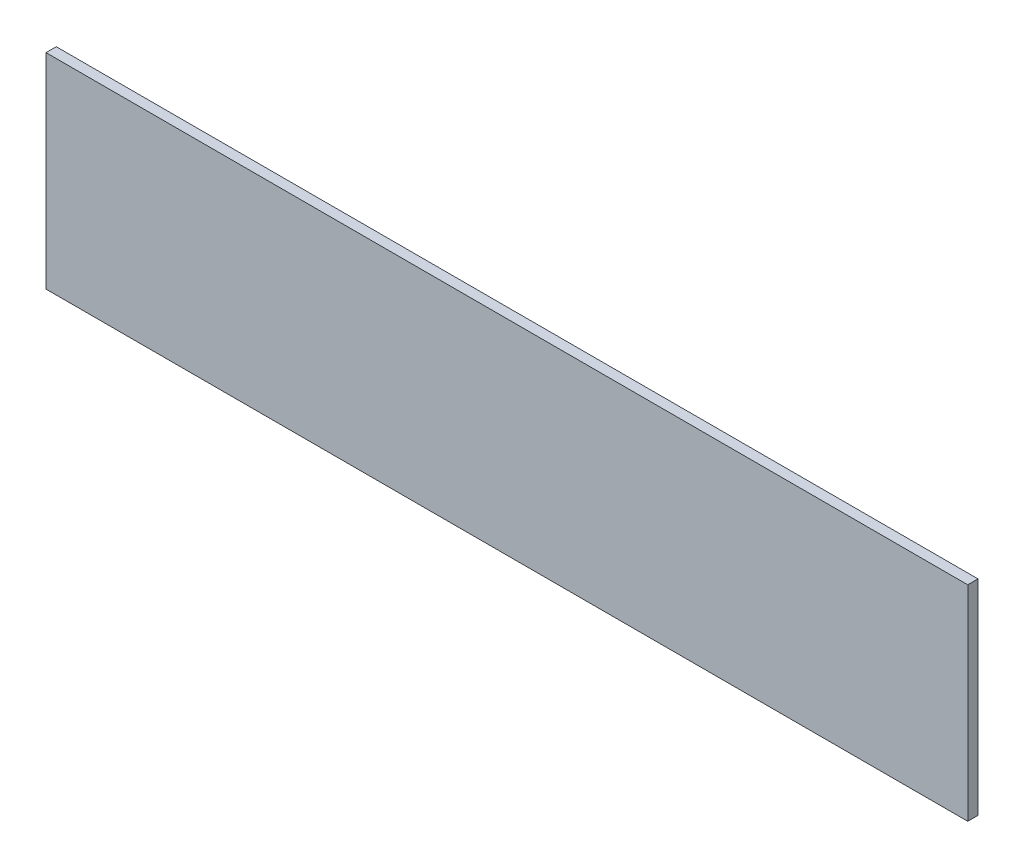
ISO-10303-21;
HEADER;
FILE_DESCRIPTION(('STEP AP214'),'2;1');
FILE_NAME('part.step','',(''),(''),'','','');
FILE_SCHEMA(('AUTOMOTIVE_DESIGN { 1 0 10303 214 1 1 1 1 }'));
ENDSEC;
DATA;
#1=APPLICATION_CONTEXT('core data for automotive mechanical design processes');
#2=APPLICATION_PROTOCOL_DEFINITION('international standard','automotive_design',2000,#1);
#3=PRODUCT_CONTEXT('',#1,'mechanical');
#4=PRODUCT('Part','Part','',(#3));
#5=PRODUCT_RELATED_PRODUCT_CATEGORY('part','',(#4));
#6=PRODUCT_DEFINITION_FORMATION('','',#4);
#7=PRODUCT_DEFINITION_CONTEXT('part definition',#1,'design');
#8=PRODUCT_DEFINITION('design','',#6,#7);
#9=PRODUCT_DEFINITION_SHAPE('','',#8);
#10=(LENGTH_UNIT() NAMED_UNIT(*) SI_UNIT(.MILLI.,.METRE.));
#11=(NAMED_UNIT(*) PLANE_ANGLE_UNIT() SI_UNIT($,.RADIAN.));
#12=(NAMED_UNIT(*) SI_UNIT($,.STERADIAN.) SOLID_ANGLE_UNIT());
#13=UNCERTAINTY_MEASURE_WITH_UNIT(LENGTH_MEASURE(1.E-05),#10,'distance_accuracy_value','');
#14=(GEOMETRIC_REPRESENTATION_CONTEXT(3) GLOBAL_UNCERTAINTY_ASSIGNED_CONTEXT((#13)) GLOBAL_UNIT_ASSIGNED_CONTEXT((#10,
#11,#12)) REPRESENTATION_CONTEXT('',''));
#15=CARTESIAN_POINT('',(0.,0.,0.));
#16=DIRECTION('',(0.,0.,1.));
#17=DIRECTION('',(1.,0.,0.));
#18=AXIS2_PLACEMENT_3D('',#15,#16,#17);
#19=CARTESIAN_POINT('',(-235.43093481612,27.7196652719665,3.));
#20=DIRECTION('',(1.,0.,0.));
#21=DIRECTION('',(0.,0.,-1.));
#22=AXIS2_PLACEMENT_3D('',#19,#20,#21);
#23=PLANE('',#22);
#24=DIRECTION('',(0.,-1.,0.));
#25=VECTOR('',#24,1.);
#26=CARTESIAN_POINT('',(-235.43093481612,27.7196652719665,0.));
#27=LINE('',#26,#25);
#28=CARTESIAN_POINT('',(-235.43093481612,27.7196652719665,0.));
#29=VERTEX_POINT('',#28);
#30=CARTESIAN_POINT('',(-235.43093481612,-32.2803347280335,0.));
#31=VERTEX_POINT('',#30);
#32=EDGE_CURVE('E96',#29,#31,#27,.T.);
#33=ORIENTED_EDGE('',*,*,#32,.T.);
#34=DIRECTION('',(0.,0.,-1.));
#35=VECTOR('',#34,1.);
#36=CARTESIAN_POINT('',(-235.43093481612,-32.2803347280335,3.));
#37=LINE('',#36,#35);
#38=CARTESIAN_POINT('',(-235.43093481612,-32.2803347280335,3.));
#39=VERTEX_POINT('',#38);
#40=EDGE_CURVE('E11',#39,#31,#37,.T.);
#41=ORIENTED_EDGE('',*,*,#40,.F.);
#42=DIRECTION('',(0.,-1.,0.));
#43=VECTOR('',#42,1.);
#44=CARTESIAN_POINT('',(-235.43093481612,27.7196652719665,3.));
#45=LINE('',#44,#43);
#46=CARTESIAN_POINT('',(-235.43093481612,27.7196652719665,3.));
#47=VERTEX_POINT('',#46);
#48=EDGE_CURVE('E84',#47,#39,#45,.T.);
#49=ORIENTED_EDGE('',*,*,#48,.F.);
#50=DIRECTION('',(0.,0.,-1.));
#51=VECTOR('',#50,1.);
#52=CARTESIAN_POINT('',(-235.43093481612,27.7196652719665,3.));
#53=LINE('',#52,#51);
#54=EDGE_CURVE('E92',#47,#29,#53,.T.);
#55=ORIENTED_EDGE('',*,*,#54,.T.);
#56=EDGE_LOOP('',(#33,#41,#49,#55));
#57=FACE_BOUND('',#56,.T.);
#58=ADVANCED_FACE('F33',(#57),#23,.F.);
#59=CARTESIAN_POINT('',(-235.43093481612,-32.2803347280335,3.));
#60=DIRECTION('',(0.,1.,0.));
#61=DIRECTION('',(0.,0.,1.));
#62=AXIS2_PLACEMENT_3D('',#59,#60,#61);
#63=PLANE('',#62);
#64=DIRECTION('',(1.,0.,0.));
#65=VECTOR('',#64,1.);
#66=CARTESIAN_POINT('',(-235.43093481612,-32.2803347280335,0.));
#67=LINE('',#66,#65);
#68=CARTESIAN_POINT('',(34.5690651838802,-32.2803347280335,0.));
#69=VERTEX_POINT('',#68);
#70=EDGE_CURVE('E88',#31,#69,#67,.T.);
#71=ORIENTED_EDGE('',*,*,#70,.T.);
#72=DIRECTION('',(0.,0.,-1.));
#73=VECTOR('',#72,1.);
#74=CARTESIAN_POINT('',(34.5690651838802,-32.2803347280335,3.));
#75=LINE('',#74,#73);
#76=CARTESIAN_POINT('',(34.5690651838802,-32.2803347280335,3.));
#77=VERTEX_POINT('',#76);
#78=EDGE_CURVE('E41',#77,#69,#75,.T.);
#79=ORIENTED_EDGE('',*,*,#78,.F.);
#80=DIRECTION('',(1.,0.,0.));
#81=VECTOR('',#80,1.);
#82=CARTESIAN_POINT('',(-235.43093481612,-32.2803347280335,3.));
#83=LINE('',#82,#81);
#84=EDGE_CURVE('E79',#39,#77,#83,.T.);
#85=ORIENTED_EDGE('',*,*,#84,.F.);
#86=ORIENTED_EDGE('',*,*,#40,.T.);
#87=EDGE_LOOP('',(#71,#79,#85,#86));
#88=FACE_BOUND('',#87,.T.);
#89=ADVANCED_FACE('F87',(#88),#63,.F.);
#90=CARTESIAN_POINT('',(34.5690651838802,27.7196652719665,3.));
#91=DIRECTION('',(-1.,0.,0.));
#92=DIRECTION('',(0.,-1.,0.));
#93=AXIS2_PLACEMENT_3D('',#90,#91,#92);
#94=PLANE('',#93);
#95=DIRECTION('',(0.,1.,0.));
#96=VECTOR('',#95,1.);
#97=CARTESIAN_POINT('',(34.5690651838802,27.7196652719665,0.));
#98=LINE('',#97,#96);
#99=CARTESIAN_POINT('',(34.5690651838802,27.7196652719665,0.));
#100=VERTEX_POINT('',#99);
#101=EDGE_CURVE('E66',#69,#100,#98,.T.);
#102=ORIENTED_EDGE('',*,*,#101,.T.);
#103=DIRECTION('',(0.,0.,-1.));
#104=VECTOR('',#103,1.);
#105=CARTESIAN_POINT('',(34.5690651838802,27.7196652719665,3.));
#106=LINE('',#105,#104);
#107=CARTESIAN_POINT('',(34.5690651838802,27.7196652719665,3.));
#108=VERTEX_POINT('',#107);
#109=EDGE_CURVE('E89',#108,#100,#106,.T.);
#110=ORIENTED_EDGE('',*,*,#109,.F.);
#111=DIRECTION('',(0.,1.,0.));
#112=VECTOR('',#111,1.);
#113=CARTESIAN_POINT('',(34.5690651838802,27.7196652719665,3.));
#114=LINE('',#113,#112);
#115=EDGE_CURVE('E82',#77,#108,#114,.T.);
#116=ORIENTED_EDGE('',*,*,#115,.F.);
#117=ORIENTED_EDGE('',*,*,#78,.T.);
#118=EDGE_LOOP('',(#102,#110,#116,#117));
#119=FACE_BOUND('',#118,.T.);
#120=ADVANCED_FACE('F90',(#119),#94,.F.);
#121=CARTESIAN_POINT('',(-235.43093481612,27.7196652719665,3.));
#122=DIRECTION('',(0.,-1.,0.));
#123=DIRECTION('',(0.,0.,-1.));
#124=AXIS2_PLACEMENT_3D('',#121,#122,#123);
#125=PLANE('',#124);
#126=DIRECTION('',(-1.,0.,0.));
#127=VECTOR('',#126,1.);
#128=CARTESIAN_POINT('',(-235.43093481612,27.7196652719665,0.));
#129=LINE('',#128,#127);
#130=EDGE_CURVE('E72',#100,#29,#129,.T.);
#131=ORIENTED_EDGE('',*,*,#130,.T.);
#132=ORIENTED_EDGE('',*,*,#54,.F.);
#133=DIRECTION('',(-1.,0.,0.));
#134=VECTOR('',#133,1.);
#135=CARTESIAN_POINT('',(-235.43093481612,27.7196652719665,3.));
#136=LINE('',#135,#134);
#137=EDGE_CURVE('E49',#108,#47,#136,.T.);
#138=ORIENTED_EDGE('',*,*,#137,.F.);
#139=ORIENTED_EDGE('',*,*,#109,.T.);
#140=EDGE_LOOP('',(#131,#132,#138,#139));
#141=FACE_BOUND('',#140,.T.);
#142=ADVANCED_FACE('F103',(#141),#125,.F.);
#143=CARTESIAN_POINT('',(0.,0.,3.));
#144=DIRECTION('',(0.,0.,1.));
#145=DIRECTION('',(1.,0.,0.));
#146=AXIS2_PLACEMENT_3D('',#143,#144,#145);
#147=PLANE('',#146);
#148=ORIENTED_EDGE('',*,*,#48,.T.);
#149=ORIENTED_EDGE('',*,*,#84,.T.);
#150=ORIENTED_EDGE('',*,*,#115,.T.);
#151=ORIENTED_EDGE('',*,*,#137,.T.);
#152=EDGE_LOOP('',(#148,#149,#150,#151));
#153=FACE_BOUND('',#152,.T.);
#154=ADVANCED_FACE('F80',(#153),#147,.T.);
#155=CARTESIAN_POINT('',(0.,0.,0.));
#156=DIRECTION('',(0.,0.,1.));
#157=DIRECTION('',(1.,0.,0.));
#158=AXIS2_PLACEMENT_3D('',#155,#156,#157);
#159=PLANE('',#158);
#160=ORIENTED_EDGE('',*,*,#32,.F.);
#161=ORIENTED_EDGE('',*,*,#130,.F.);
#162=ORIENTED_EDGE('',*,*,#101,.F.);
#163=ORIENTED_EDGE('',*,*,#70,.F.);
#164=EDGE_LOOP('',(#160,#161,#162,#163));
#165=FACE_BOUND('',#164,.T.);
#166=ADVANCED_FACE('F106',(#165),#159,.F.);
#167=CLOSED_SHELL('',(#58,#89,#120,#142,#154,#166));
#168=MANIFOLD_SOLID_BREP('B2',#167);
#169=ADVANCED_BREP_SHAPE_REPRESENTATION('',(#18,#168),#14);
#170=SHAPE_DEFINITION_REPRESENTATION(#9,#169);
ENDSEC;
END-ISO-10303-21;
